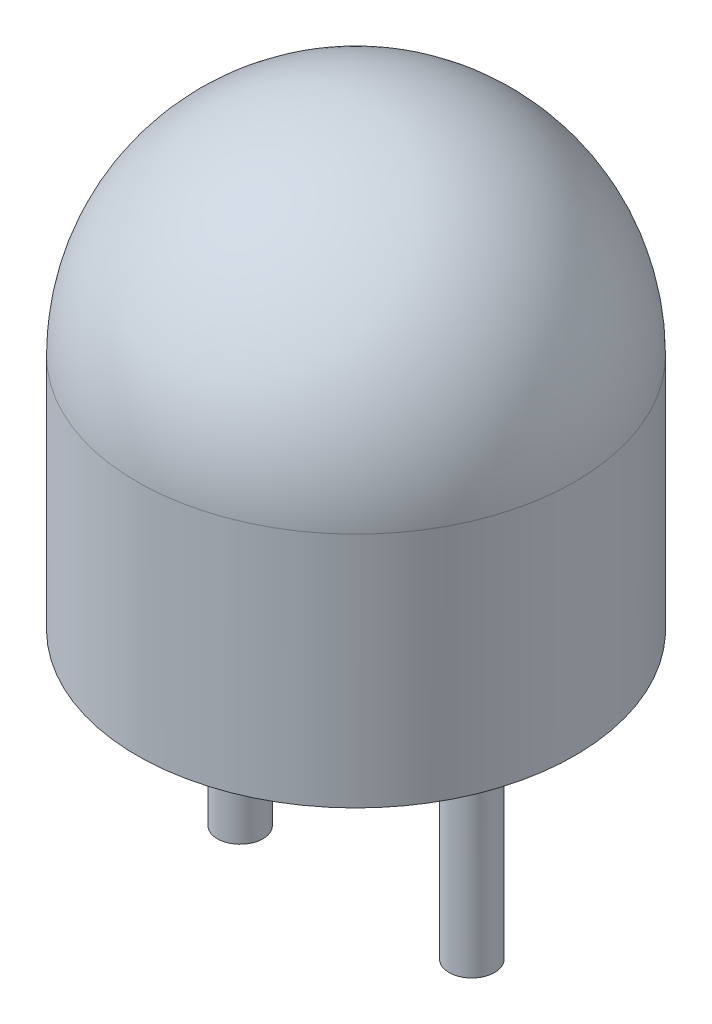
ISO-10303-21;
HEADER;
FILE_DESCRIPTION(('STEP AP214'),'2;1');
FILE_NAME('part.step','',(''),(''),'','','');
FILE_SCHEMA(('AUTOMOTIVE_DESIGN { 1 0 10303 214 1 1 1 1 }'));
ENDSEC;
DATA;
#1=APPLICATION_CONTEXT('core data for automotive mechanical design processes');
#2=APPLICATION_PROTOCOL_DEFINITION('international standard','automotive_design',2000,#1);
#3=PRODUCT_CONTEXT('',#1,'mechanical');
#4=PRODUCT('Part','Part','',(#3));
#5=PRODUCT_RELATED_PRODUCT_CATEGORY('part','',(#4));
#6=PRODUCT_DEFINITION_FORMATION('','',#4);
#7=PRODUCT_DEFINITION_CONTEXT('part definition',#1,'design');
#8=PRODUCT_DEFINITION('design','',#6,#7);
#9=PRODUCT_DEFINITION_SHAPE('','',#8);
#10=(LENGTH_UNIT() NAMED_UNIT(*) SI_UNIT(.MILLI.,.METRE.));
#11=(NAMED_UNIT(*) PLANE_ANGLE_UNIT() SI_UNIT($,.RADIAN.));
#12=(NAMED_UNIT(*) SI_UNIT($,.STERADIAN.) SOLID_ANGLE_UNIT());
#13=UNCERTAINTY_MEASURE_WITH_UNIT(LENGTH_MEASURE(1.E-05),#10,'distance_accuracy_value','');
#14=(GEOMETRIC_REPRESENTATION_CONTEXT(3) GLOBAL_UNCERTAINTY_ASSIGNED_CONTEXT((#13)) GLOBAL_UNIT_ASSIGNED_CONTEXT((#10,
#11,#12)) REPRESENTATION_CONTEXT('',''));
#15=CARTESIAN_POINT('',(0.,0.,0.));
#16=DIRECTION('',(0.,0.,1.));
#17=DIRECTION('',(1.,0.,0.));
#18=AXIS2_PLACEMENT_3D('',#15,#16,#17);
#19=CARTESIAN_POINT('',(0.,0.,0.));
#20=DIRECTION('',(0.,-1.,0.));
#21=DIRECTION('',(0.,0.,-1.));
#22=AXIS2_PLACEMENT_3D('',#19,#20,#21);
#23=PLANE('',#22);
#24=CARTESIAN_POINT('',(0.,0.,0.));
#25=DIRECTION('',(0.,-1.,0.));
#26=DIRECTION('',(0.,0.,-1.));
#27=AXIS2_PLACEMENT_3D('',#24,#25,#26);
#28=CIRCLE('',#27,2.4);
#29=CARTESIAN_POINT('',(0.,0.,-2.4));
#30=VERTEX_POINT('',#29);
#31=EDGE_CURVE('E11',#30,#30,#28,.T.);
#32=ORIENTED_EDGE('',*,*,#31,.T.);
#33=EDGE_LOOP('',(#32));
#34=FACE_BOUND('',#33,.T.);
#35=ADVANCED_FACE('F43',(#34),#23,.T.);
#36=CARTESIAN_POINT('',(0.,0.,0.));
#37=DIRECTION('',(0.,-1.,0.));
#38=DIRECTION('',(0.,0.,-1.));
#39=AXIS2_PLACEMENT_3D('',#36,#37,#38);
#40=CYLINDRICAL_SURFACE('',#39,2.4);
#41=CARTESIAN_POINT('',(0.,2.6,0.));
#42=DIRECTION('',(0.,-1.,0.));
#43=DIRECTION('',(0.,0.,-1.));
#44=AXIS2_PLACEMENT_3D('',#41,#42,#43);
#45=CIRCLE('',#44,2.4);
#46=CARTESIAN_POINT('',(0.,2.6,-2.4));
#47=VERTEX_POINT('',#46);
#48=EDGE_CURVE('E49',#47,#47,#45,.T.);
#49=ORIENTED_EDGE('',*,*,#48,.T.);
#50=EDGE_LOOP('',(#49));
#51=FACE_BOUND('',#50,.T.);
#52=ORIENTED_EDGE('',*,*,#31,.F.);
#53=EDGE_LOOP('',(#52));
#54=FACE_BOUND('',#53,.T.);
#55=ADVANCED_FACE('F55',(#51,#54),#40,.T.);
#56=CARTESIAN_POINT('',(0.,2.6,0.));
#57=DIRECTION('',(0.,-1.,0.));
#58=DIRECTION('',(1.,0.,0.));
#59=AXIS2_PLACEMENT_3D('',#56,#57,#58);
#60=SPHERICAL_SURFACE('',#59,2.4);
#61=ORIENTED_EDGE('',*,*,#48,.F.);
#62=EDGE_LOOP('',(#61));
#63=FACE_BOUND('',#62,.T.);
#64=ADVANCED_FACE('F58',(#63),#60,.T.);
#65=CLOSED_SHELL('',(#35,#55,#64));
#66=MANIFOLD_SOLID_BREP('B2',#65);
#67=CARTESIAN_POINT('',(-1.27,0.,0.));
#68=DIRECTION('',(0.,1.,0.));
#69=DIRECTION('',(0.,0.,1.));
#70=AXIS2_PLACEMENT_3D('',#67,#68,#69);
#71=PLANE('',#70);
#72=CARTESIAN_POINT('',(-1.27,0.,0.));
#73=DIRECTION('',(0.,1.,0.));
#74=DIRECTION('',(0.,0.,1.));
#75=AXIS2_PLACEMENT_3D('',#72,#73,#74);
#76=CIRCLE('',#75,0.25);
#77=CARTESIAN_POINT('',(-1.04087121525221,0.,-0.1));
#78=VERTEX_POINT('',#77);
#79=CARTESIAN_POINT('',(-1.49912878474779,0.,-0.1));
#80=VERTEX_POINT('',#79);
#81=EDGE_CURVE('E193',#78,#80,#76,.T.);
#82=ORIENTED_EDGE('',*,*,#81,.T.);
#83=DIRECTION('',(1.,0.,0.));
#84=VECTOR('',#83,1.);
#85=CARTESIAN_POINT('',(-1.02,0.,-0.1));
#86=LINE('',#85,#84);
#87=EDGE_CURVE('E41',#80,#78,#86,.T.);
#88=ORIENTED_EDGE('',*,*,#87,.T.);
#89=EDGE_LOOP('',(#82,#88));
#90=FACE_BOUND('',#89,.T.);
#91=ADVANCED_FACE('F92',(#90),#71,.T.);
#92=CARTESIAN_POINT('',(-1.27,-2.5,0.));
#93=DIRECTION('',(0.,1.,0.));
#94=DIRECTION('',(0.,0.,1.));
#95=AXIS2_PLACEMENT_3D('',#92,#93,#94);
#96=CYLINDRICAL_SURFACE('',#95,0.25);
#97=CARTESIAN_POINT('',(-1.27,-2.5,0.));
#98=DIRECTION('',(0.,1.,0.));
#99=DIRECTION('',(0.,0.,1.));
#100=AXIS2_PLACEMENT_3D('',#97,#98,#99);
#101=CIRCLE('',#100,0.25);
#102=CARTESIAN_POINT('',(-1.27,-2.5,0.25));
#103=VERTEX_POINT('',#102);
#104=EDGE_CURVE('E187',#103,#103,#101,.T.);
#105=ORIENTED_EDGE('',*,*,#104,.T.);
#106=EDGE_LOOP('',(#105));
#107=FACE_BOUND('',#106,.T.);
#108=CARTESIAN_POINT('',(-1.04087121525221,0.,0.1));
#109=VERTEX_POINT('',#108);
#110=CARTESIAN_POINT('',(-1.02,0.,0.));
#111=VERTEX_POINT('',#110);
#112=EDGE_CURVE('E96',#109,#111,#76,.T.);
#113=ORIENTED_EDGE('',*,*,#112,.F.);
#114=CARTESIAN_POINT('',(-1.49912878474779,0.,0.1));
#115=VERTEX_POINT('',#114);
#116=EDGE_CURVE('E182',#115,#109,#76,.T.);
#117=ORIENTED_EDGE('',*,*,#116,.F.);
#118=CARTESIAN_POINT('',(-1.52,0.,0.));
#119=VERTEX_POINT('',#118);
#120=EDGE_CURVE('E116',#119,#115,#76,.T.);
#121=ORIENTED_EDGE('',*,*,#120,.F.);
#122=EDGE_CURVE('E198',#80,#119,#76,.T.);
#123=ORIENTED_EDGE('',*,*,#122,.F.);
#124=ORIENTED_EDGE('',*,*,#81,.F.);
#125=EDGE_CURVE('E191',#111,#78,#76,.T.);
#126=ORIENTED_EDGE('',*,*,#125,.F.);
#127=EDGE_LOOP('',(#113,#117,#121,#123,#124,#126));
#128=FACE_BOUND('',#127,.T.);
#129=ADVANCED_FACE('F94',(#107,#128),#96,.T.);
#130=CARTESIAN_POINT('',(-1.27,-2.5,0.));
#131=DIRECTION('',(0.,1.,0.));
#132=DIRECTION('',(0.,0.,1.));
#133=AXIS2_PLACEMENT_3D('',#130,#131,#132);
#134=PLANE('',#133);
#135=ORIENTED_EDGE('',*,*,#104,.F.);
#136=EDGE_LOOP('',(#135));
#137=FACE_BOUND('',#136,.T.);
#138=ADVANCED_FACE('F251',(#137),#134,.F.);
#139=DIRECTION('',(1.,0.,0.));
#140=VECTOR('',#139,1.);
#141=CARTESIAN_POINT('',(-1.02,0.,0.1));
#142=LINE('',#141,#140);
#143=EDGE_CURVE('E101',#115,#109,#142,.T.);
#144=ORIENTED_EDGE('',*,*,#143,.F.);
#145=ORIENTED_EDGE('',*,*,#116,.T.);
#146=EDGE_LOOP('',(#144,#145));
#147=FACE_BOUND('',#146,.T.);
#148=ADVANCED_FACE('F249',(#147),#71,.T.);
#149=CARTESIAN_POINT('',(-1.02,0.,0.1));
#150=DIRECTION('',(0.,1.,0.));
#151=DIRECTION('',(0.,0.,1.));
#152=AXIS2_PLACEMENT_3D('',#149,#150,#151);
#153=PLANE('',#152);
#154=CARTESIAN_POINT('',(-1.02,0.,0.1));
#155=VERTEX_POINT('',#154);
#156=EDGE_CURVE('E159',#109,#155,#142,.T.);
#157=ORIENTED_EDGE('',*,*,#156,.F.);
#158=ORIENTED_EDGE('',*,*,#112,.T.);
#159=DIRECTION('',(0.,0.,-1.));
#160=VECTOR('',#159,1.);
#161=CARTESIAN_POINT('',(-1.02,0.,0.1));
#162=LINE('',#161,#160);
#163=EDGE_CURVE('E174',#155,#111,#162,.T.);
#164=ORIENTED_EDGE('',*,*,#163,.F.);
#165=EDGE_LOOP('',(#157,#158,#164));
#166=FACE_BOUND('',#165,.T.);
#167=ADVANCED_FACE('F180',(#166),#153,.F.);
#168=CARTESIAN_POINT('',(-1.02,0.,-0.1));
#169=VERTEX_POINT('',#168);
#170=EDGE_CURVE('E183',#111,#169,#162,.T.);
#171=ORIENTED_EDGE('',*,*,#170,.F.);
#172=ORIENTED_EDGE('',*,*,#125,.T.);
#173=EDGE_CURVE('E104',#78,#169,#86,.T.);
#174=ORIENTED_EDGE('',*,*,#173,.T.);
#175=EDGE_LOOP('',(#171,#172,#174));
#176=FACE_BOUND('',#175,.T.);
#177=ADVANCED_FACE('F256',(#176),#153,.F.);
#178=CARTESIAN_POINT('',(-1.52,0.,-0.1));
#179=VERTEX_POINT('',#178);
#180=EDGE_CURVE('E103',#179,#80,#86,.T.);
#181=ORIENTED_EDGE('',*,*,#180,.T.);
#182=ORIENTED_EDGE('',*,*,#122,.T.);
#183=DIRECTION('',(0.,0.,-1.));
#184=VECTOR('',#183,1.);
#185=CARTESIAN_POINT('',(-1.52,0.,0.1));
#186=LINE('',#185,#184);
#187=EDGE_CURVE('E217',#119,#179,#186,.T.);
#188=ORIENTED_EDGE('',*,*,#187,.T.);
#189=EDGE_LOOP('',(#181,#182,#188));
#190=FACE_BOUND('',#189,.T.);
#191=ADVANCED_FACE('F248',(#190),#153,.F.);
#192=CARTESIAN_POINT('',(-1.52,0.,0.1));
#193=VERTEX_POINT('',#192);
#194=EDGE_CURVE('E210',#193,#119,#186,.T.);
#195=ORIENTED_EDGE('',*,*,#194,.T.);
#196=ORIENTED_EDGE('',*,*,#120,.T.);
#197=EDGE_CURVE('E168',#193,#115,#142,.T.);
#198=ORIENTED_EDGE('',*,*,#197,.F.);
#199=EDGE_LOOP('',(#195,#196,#198));
#200=FACE_BOUND('',#199,.T.);
#201=ADVANCED_FACE('F208',(#200),#153,.F.);
#202=CARTESIAN_POINT('',(-1.02,1.3,0.1));
#203=DIRECTION('',(-1.,0.,0.));
#204=DIRECTION('',(0.,0.,1.));
#205=AXIS2_PLACEMENT_3D('',#202,#203,#204);
#206=PLANE('',#205);
#207=DIRECTION('',(0.,1.,0.));
#208=VECTOR('',#207,1.);
#209=CARTESIAN_POINT('',(-1.02,1.3,-0.1));
#210=LINE('',#209,#208);
#211=CARTESIAN_POINT('',(-1.02,1.3,-0.1));
#212=VERTEX_POINT('',#211);
#213=EDGE_CURVE('E219',#169,#212,#210,.T.);
#214=ORIENTED_EDGE('',*,*,#213,.T.);
#215=DIRECTION('',(0.,0.,-1.));
#216=VECTOR('',#215,1.);
#217=CARTESIAN_POINT('',(-1.02,1.3,0.1));
#218=LINE('',#217,#216);
#219=CARTESIAN_POINT('',(-1.02,1.3,0.1));
#220=VERTEX_POINT('',#219);
#221=EDGE_CURVE('E176',#220,#212,#218,.T.);
#222=ORIENTED_EDGE('',*,*,#221,.F.);
#223=DIRECTION('',(0.,1.,0.));
#224=VECTOR('',#223,1.);
#225=CARTESIAN_POINT('',(-1.02,1.3,0.1));
#226=LINE('',#225,#224);
#227=EDGE_CURVE('E163',#155,#220,#226,.T.);
#228=ORIENTED_EDGE('',*,*,#227,.F.);
#229=ORIENTED_EDGE('',*,*,#163,.T.);
#230=ORIENTED_EDGE('',*,*,#170,.T.);
#231=EDGE_LOOP('',(#214,#222,#228,#229,#230));
#232=FACE_BOUND('',#231,.T.);
#233=ADVANCED_FACE('F173',(#232),#206,.F.);
#234=CARTESIAN_POINT('',(-0.5,1.3,0.1));
#235=DIRECTION('',(0.,1.,0.));
#236=DIRECTION('',(-1.,0.,0.));
#237=AXIS2_PLACEMENT_3D('',#234,#235,#236);
#238=PLANE('',#237);
#239=DIRECTION('',(1.,0.,0.));
#240=VECTOR('',#239,1.);
#241=CARTESIAN_POINT('',(-0.5,1.3,-0.1));
#242=LINE('',#241,#240);
#243=CARTESIAN_POINT('',(-0.5,1.3,-0.1));
#244=VERTEX_POINT('',#243);
#245=EDGE_CURVE('E221',#212,#244,#242,.T.);
#246=ORIENTED_EDGE('',*,*,#245,.T.);
#247=DIRECTION('',(0.,0.,-1.));
#248=VECTOR('',#247,1.);
#249=CARTESIAN_POINT('',(-0.5,1.3,0.1));
#250=LINE('',#249,#248);
#251=CARTESIAN_POINT('',(-0.5,1.3,0.1));
#252=VERTEX_POINT('',#251);
#253=EDGE_CURVE('E230',#252,#244,#250,.T.);
#254=ORIENTED_EDGE('',*,*,#253,.F.);
#255=DIRECTION('',(1.,0.,0.));
#256=VECTOR('',#255,1.);
#257=CARTESIAN_POINT('',(-0.5,1.3,0.1));
#258=LINE('',#257,#256);
#259=EDGE_CURVE('E178',#220,#252,#258,.T.);
#260=ORIENTED_EDGE('',*,*,#259,.F.);
#261=ORIENTED_EDGE('',*,*,#221,.T.);
#262=EDGE_LOOP('',(#246,#254,#260,#261));
#263=FACE_BOUND('',#262,.T.);
#264=ADVANCED_FACE('F238',(#263),#238,.F.);
#265=CARTESIAN_POINT('',(-1.52,3.,0.1));
#266=DIRECTION('',(-0.857492925712544,-0.514495755427527,0.));
#267=DIRECTION('',(0.514495755427527,-0.857492925712544,0.));
#268=AXIS2_PLACEMENT_3D('',#265,#266,#267);
#269=PLANE('',#268);
#270=DIRECTION('',(-0.514495755427527,0.857492925712544,0.));
#271=VECTOR('',#270,1.);
#272=CARTESIAN_POINT('',(-1.52,3.,-0.1));
#273=LINE('',#272,#271);
#274=CARTESIAN_POINT('',(-1.52,3.,-0.1));
#275=VERTEX_POINT('',#274);
#276=EDGE_CURVE('E223',#244,#275,#273,.T.);
#277=ORIENTED_EDGE('',*,*,#276,.T.);
#278=DIRECTION('',(0.,0.,-1.));
#279=VECTOR('',#278,1.);
#280=CARTESIAN_POINT('',(-1.52,3.,0.1));
#281=LINE('',#280,#279);
#282=CARTESIAN_POINT('',(-1.52,3.,0.1));
#283=VERTEX_POINT('',#282);
#284=EDGE_CURVE('E228',#283,#275,#281,.T.);
#285=ORIENTED_EDGE('',*,*,#284,.F.);
#286=DIRECTION('',(-0.514495755427527,0.857492925712544,0.));
#287=VECTOR('',#286,1.);
#288=CARTESIAN_POINT('',(-1.52,3.,0.1));
#289=LINE('',#288,#287);
#290=EDGE_CURVE('E215',#252,#283,#289,.T.);
#291=ORIENTED_EDGE('',*,*,#290,.F.);
#292=ORIENTED_EDGE('',*,*,#253,.T.);
#293=EDGE_LOOP('',(#277,#285,#291,#292));
#294=FACE_BOUND('',#293,.T.);
#295=ADVANCED_FACE('F245',(#294),#269,.F.);
#296=CARTESIAN_POINT('',(-1.52,0.,0.1));
#297=DIRECTION('',(1.,0.,0.));
#298=DIRECTION('',(0.,0.,-1.));
#299=AXIS2_PLACEMENT_3D('',#296,#297,#298);
#300=PLANE('',#299);
#301=DIRECTION('',(0.,-1.,0.));
#302=VECTOR('',#301,1.);
#303=CARTESIAN_POINT('',(-1.52,0.,-0.1));
#304=LINE('',#303,#302);
#305=EDGE_CURVE('E169',#275,#179,#304,.T.);
#306=ORIENTED_EDGE('',*,*,#305,.T.);
#307=ORIENTED_EDGE('',*,*,#187,.F.);
#308=ORIENTED_EDGE('',*,*,#194,.F.);
#309=DIRECTION('',(0.,-1.,0.));
#310=VECTOR('',#309,1.);
#311=CARTESIAN_POINT('',(-1.52,0.,0.1));
#312=LINE('',#311,#310);
#313=EDGE_CURVE('E212',#283,#193,#312,.T.);
#314=ORIENTED_EDGE('',*,*,#313,.F.);
#315=ORIENTED_EDGE('',*,*,#284,.T.);
#316=EDGE_LOOP('',(#306,#307,#308,#314,#315));
#317=FACE_BOUND('',#316,.T.);
#318=ADVANCED_FACE('F247',(#317),#300,.F.);
#319=CARTESIAN_POINT('',(0.,0.,0.1));
#320=DIRECTION('',(0.,0.,-1.));
#321=DIRECTION('',(-1.,0.,0.));
#322=AXIS2_PLACEMENT_3D('',#319,#320,#321);
#323=PLANE('',#322);
#324=ORIENTED_EDGE('',*,*,#197,.T.);
#325=ORIENTED_EDGE('',*,*,#143,.T.);
#326=ORIENTED_EDGE('',*,*,#156,.T.);
#327=ORIENTED_EDGE('',*,*,#227,.T.);
#328=ORIENTED_EDGE('',*,*,#259,.T.);
#329=ORIENTED_EDGE('',*,*,#290,.T.);
#330=ORIENTED_EDGE('',*,*,#313,.T.);
#331=EDGE_LOOP('',(#324,#325,#326,#327,#328,#329,#330));
#332=FACE_BOUND('',#331,.T.);
#333=ADVANCED_FACE('F162',(#332),#323,.F.);
#334=CARTESIAN_POINT('',(0.,0.,-0.1));
#335=DIRECTION('',(0.,0.,-1.));
#336=DIRECTION('',(-1.,0.,0.));
#337=AXIS2_PLACEMENT_3D('',#334,#335,#336);
#338=PLANE('',#337);
#339=ORIENTED_EDGE('',*,*,#180,.F.);
#340=ORIENTED_EDGE('',*,*,#305,.F.);
#341=ORIENTED_EDGE('',*,*,#276,.F.);
#342=ORIENTED_EDGE('',*,*,#245,.F.);
#343=ORIENTED_EDGE('',*,*,#213,.F.);
#344=ORIENTED_EDGE('',*,*,#173,.F.);
#345=ORIENTED_EDGE('',*,*,#87,.F.);
#346=EDGE_LOOP('',(#339,#340,#341,#342,#343,#344,#345));
#347=FACE_BOUND('',#346,.T.);
#348=ADVANCED_FACE('F242',(#347),#338,.T.);
#349=CLOSED_SHELL('',(#91,#129,#138,#148,#167,#177,#191,#201,#233,#264,#295,#318,#333,#348));
#350=MANIFOLD_SOLID_BREP('B6',#349);
#351=CARTESIAN_POINT('',(1.27,0.,0.));
#352=DIRECTION('',(0.,1.,0.));
#353=DIRECTION('',(0.,0.,1.));
#354=AXIS2_PLACEMENT_3D('',#351,#352,#353);
#355=PLANE('',#354);
#356=CARTESIAN_POINT('',(1.27,0.,0.));
#357=DIRECTION('',(0.,1.,0.));
#358=DIRECTION('',(0.,0.,1.));
#359=AXIS2_PLACEMENT_3D('',#356,#357,#358);
#360=CIRCLE('',#359,0.25);
#361=CARTESIAN_POINT('',(1.49912878474779,0.,-0.1));
#362=VERTEX_POINT('',#361);
#363=CARTESIAN_POINT('',(1.04087121525221,0.,-0.1));
#364=VERTEX_POINT('',#363);
#365=EDGE_CURVE('E561',#362,#364,#360,.T.);
#366=ORIENTED_EDGE('',*,*,#365,.T.);
#367=DIRECTION('',(1.,0.,0.));
#368=VECTOR('',#367,1.);
#369=CARTESIAN_POINT('',(1.02,0.,-0.1));
#370=LINE('',#369,#368);
#371=EDGE_CURVE('E374',#364,#362,#370,.T.);
#372=ORIENTED_EDGE('',*,*,#371,.T.);
#373=EDGE_LOOP('',(#366,#372));
#374=FACE_BOUND('',#373,.T.);
#375=ADVANCED_FACE('F361',(#374),#355,.T.);
#376=CARTESIAN_POINT('',(1.27,-2.5,0.));
#377=DIRECTION('',(0.,1.,0.));
#378=DIRECTION('',(0.,0.,1.));
#379=AXIS2_PLACEMENT_3D('',#376,#377,#378);
#380=CYLINDRICAL_SURFACE('',#379,0.25);
#381=CARTESIAN_POINT('',(1.27,-2.5,0.));
#382=DIRECTION('',(0.,1.,0.));
#383=DIRECTION('',(0.,0.,1.));
#384=AXIS2_PLACEMENT_3D('',#381,#382,#383);
#385=CIRCLE('',#384,0.25);
#386=CARTESIAN_POINT('',(1.27,-2.5,0.25));
#387=VERTEX_POINT('',#386);
#388=EDGE_CURVE('E511',#387,#387,#385,.T.);
#389=ORIENTED_EDGE('',*,*,#388,.T.);
#390=EDGE_LOOP('',(#389));
#391=FACE_BOUND('',#390,.T.);
#392=CARTESIAN_POINT('',(1.49912878474779,0.,0.1));
#393=VERTEX_POINT('',#392);
#394=CARTESIAN_POINT('',(1.52,0.,0.));
#395=VERTEX_POINT('',#394);
#396=EDGE_CURVE('E518',#393,#395,#360,.T.);
#397=ORIENTED_EDGE('',*,*,#396,.F.);
#398=CARTESIAN_POINT('',(1.04087121525221,0.,0.1));
#399=VERTEX_POINT('',#398);
#400=EDGE_CURVE('E508',#399,#393,#360,.T.);
#401=ORIENTED_EDGE('',*,*,#400,.F.);
#402=CARTESIAN_POINT('',(1.02,0.,0.));
#403=VERTEX_POINT('',#402);
#404=EDGE_CURVE('E515',#403,#399,#360,.T.);
#405=ORIENTED_EDGE('',*,*,#404,.F.);
#406=EDGE_CURVE('E525',#364,#403,#360,.T.);
#407=ORIENTED_EDGE('',*,*,#406,.F.);
#408=ORIENTED_EDGE('',*,*,#365,.F.);
#409=EDGE_CURVE('E557',#395,#362,#360,.T.);
#410=ORIENTED_EDGE('',*,*,#409,.F.);
#411=EDGE_LOOP('',(#397,#401,#405,#407,#408,#410));
#412=FACE_BOUND('',#411,.T.);
#413=ADVANCED_FACE('F363',(#391,#412),#380,.T.);
#414=CARTESIAN_POINT('',(1.27,-2.5,0.));
#415=DIRECTION('',(0.,1.,0.));
#416=DIRECTION('',(0.,0.,1.));
#417=AXIS2_PLACEMENT_3D('',#414,#415,#416);
#418=PLANE('',#417);
#419=ORIENTED_EDGE('',*,*,#388,.F.);
#420=EDGE_LOOP('',(#419));
#421=FACE_BOUND('',#420,.T.);
#422=ADVANCED_FACE('F488',(#421),#418,.F.);
#423=DIRECTION('',(1.,0.,0.));
#424=VECTOR('',#423,1.);
#425=CARTESIAN_POINT('',(1.02,0.,0.1));
#426=LINE('',#425,#424);
#427=EDGE_CURVE('E506',#399,#393,#426,.T.);
#428=ORIENTED_EDGE('',*,*,#427,.F.);
#429=ORIENTED_EDGE('',*,*,#400,.T.);
#430=EDGE_LOOP('',(#428,#429));
#431=FACE_BOUND('',#430,.T.);
#432=ADVANCED_FACE('F484',(#431),#355,.T.);
#433=CARTESIAN_POINT('',(1.02,0.,0.1));
#434=DIRECTION('',(0.,1.,0.));
#435=DIRECTION('',(0.,0.,1.));
#436=AXIS2_PLACEMENT_3D('',#433,#434,#435);
#437=PLANE('',#436);
#438=CARTESIAN_POINT('',(1.52,0.,0.1));
#439=VERTEX_POINT('',#438);
#440=EDGE_CURVE('E512',#393,#439,#426,.T.);
#441=ORIENTED_EDGE('',*,*,#440,.F.);
#442=ORIENTED_EDGE('',*,*,#396,.T.);
#443=DIRECTION('',(0.,0.,-1.));
#444=VECTOR('',#443,1.);
#445=CARTESIAN_POINT('',(1.52,0.,0.1));
#446=LINE('',#445,#444);
#447=EDGE_CURVE('E519',#439,#395,#446,.T.);
#448=ORIENTED_EDGE('',*,*,#447,.F.);
#449=EDGE_LOOP('',(#441,#442,#448));
#450=FACE_BOUND('',#449,.T.);
#451=ADVANCED_FACE('F493',(#450),#437,.F.);
#452=CARTESIAN_POINT('',(1.52,0.,-0.1));
#453=VERTEX_POINT('',#452);
#454=EDGE_CURVE('E553',#395,#453,#446,.T.);
#455=ORIENTED_EDGE('',*,*,#454,.F.);
#456=ORIENTED_EDGE('',*,*,#409,.T.);
#457=EDGE_CURVE('E461',#362,#453,#370,.T.);
#458=ORIENTED_EDGE('',*,*,#457,.T.);
#459=EDGE_LOOP('',(#455,#456,#458));
#460=FACE_BOUND('',#459,.T.);
#461=ADVANCED_FACE('F499',(#460),#437,.F.);
#462=CARTESIAN_POINT('',(1.02,0.,-0.1));
#463=VERTEX_POINT('',#462);
#464=EDGE_CURVE('E570',#463,#364,#370,.T.);
#465=ORIENTED_EDGE('',*,*,#464,.T.);
#466=ORIENTED_EDGE('',*,*,#406,.T.);
#467=DIRECTION('',(0.,0.,-1.));
#468=VECTOR('',#467,1.);
#469=CARTESIAN_POINT('',(1.02,0.,0.1));
#470=LINE('',#469,#468);
#471=EDGE_CURVE('E543',#403,#463,#470,.T.);
#472=ORIENTED_EDGE('',*,*,#471,.T.);
#473=EDGE_LOOP('',(#465,#466,#472));
#474=FACE_BOUND('',#473,.T.);
#475=ADVANCED_FACE('F569',(#474),#437,.F.);
#476=CARTESIAN_POINT('',(1.02,0.,0.1));
#477=VERTEX_POINT('',#476);
#478=EDGE_CURVE('E524',#477,#403,#470,.T.);
#479=ORIENTED_EDGE('',*,*,#478,.T.);
#480=ORIENTED_EDGE('',*,*,#404,.T.);
#481=EDGE_CURVE('E471',#477,#399,#426,.T.);
#482=ORIENTED_EDGE('',*,*,#481,.F.);
#483=EDGE_LOOP('',(#479,#480,#482));
#484=FACE_BOUND('',#483,.T.);
#485=ADVANCED_FACE('F502',(#484),#437,.F.);
#486=CARTESIAN_POINT('',(1.52,0.,0.1));
#487=DIRECTION('',(-1.,0.,0.));
#488=DIRECTION('',(0.,0.,1.));
#489=AXIS2_PLACEMENT_3D('',#486,#487,#488);
#490=PLANE('',#489);
#491=DIRECTION('',(0.,1.,0.));
#492=VECTOR('',#491,1.);
#493=CARTESIAN_POINT('',(1.52,0.,-0.1));
#494=LINE('',#493,#492);
#495=CARTESIAN_POINT('',(1.52,3.,-0.1));
#496=VERTEX_POINT('',#495);
#497=EDGE_CURVE('E578',#453,#496,#494,.T.);
#498=ORIENTED_EDGE('',*,*,#497,.T.);
#499=DIRECTION('',(0.,0.,-1.));
#500=VECTOR('',#499,1.);
#501=CARTESIAN_POINT('',(1.52,3.,0.1));
#502=LINE('',#501,#500);
#503=CARTESIAN_POINT('',(1.52,3.,0.1));
#504=VERTEX_POINT('',#503);
#505=EDGE_CURVE('E551',#504,#496,#502,.T.);
#506=ORIENTED_EDGE('',*,*,#505,.F.);
#507=DIRECTION('',(0.,1.,0.));
#508=VECTOR('',#507,1.);
#509=CARTESIAN_POINT('',(1.52,0.,0.1));
#510=LINE('',#509,#508);
#511=EDGE_CURVE('E449',#439,#504,#510,.T.);
#512=ORIENTED_EDGE('',*,*,#511,.F.);
#513=ORIENTED_EDGE('',*,*,#447,.T.);
#514=ORIENTED_EDGE('',*,*,#454,.T.);
#515=EDGE_LOOP('',(#498,#506,#512,#513,#514));
#516=FACE_BOUND('',#515,.T.);
#517=ADVANCED_FACE('F598',(#516),#490,.F.);
#518=CARTESIAN_POINT('',(1.52,3.,0.1));
#519=DIRECTION('',(0.,-1.,0.));
#520=DIRECTION('',(0.,0.,-1.));
#521=AXIS2_PLACEMENT_3D('',#518,#519,#520);
#522=PLANE('',#521);
#523=DIRECTION('',(-1.,0.,0.));
#524=VECTOR('',#523,1.);
#525=CARTESIAN_POINT('',(1.52,3.,0.1));
#526=LINE('',#525,#524);
#527=CARTESIAN_POINT('',(-0.489897948556635,3.,0.1));
#528=VERTEX_POINT('',#527);
#529=CARTESIAN_POINT('',(-1.02,3.,0.1));
#530=VERTEX_POINT('',#529);
#531=EDGE_CURVE('E455',#528,#530,#526,.T.);
#532=ORIENTED_EDGE('',*,*,#531,.F.);
#533=CARTESIAN_POINT('',(0.,3.,0.));
#534=DIRECTION('',(0.,-1.,0.));
#535=DIRECTION('',(0.,0.,-1.));
#536=AXIS2_PLACEMENT_3D('',#533,#534,#535);
#537=CIRCLE('',#536,0.5);
#538=CARTESIAN_POINT('',(0.489897948556636,3.,0.1));
#539=VERTEX_POINT('',#538);
#540=EDGE_CURVE('E460',#539,#528,#537,.T.);
#541=ORIENTED_EDGE('',*,*,#540,.F.);
#542=EDGE_CURVE('E446',#504,#539,#526,.T.);
#543=ORIENTED_EDGE('',*,*,#542,.F.);
#544=ORIENTED_EDGE('',*,*,#505,.T.);
#545=DIRECTION('',(-1.,0.,0.));
#546=VECTOR('',#545,1.);
#547=CARTESIAN_POINT('',(1.52,3.,-0.1));
#548=LINE('',#547,#546);
#549=CARTESIAN_POINT('',(0.489897948556636,3.,-0.1));
#550=VERTEX_POINT('',#549);
#551=EDGE_CURVE('E581',#496,#550,#548,.T.);
#552=ORIENTED_EDGE('',*,*,#551,.T.);
#553=CARTESIAN_POINT('',(-0.489897948556635,3.,-0.1));
#554=VERTEX_POINT('',#553);
#555=EDGE_CURVE('E388',#554,#550,#537,.T.);
#556=ORIENTED_EDGE('',*,*,#555,.F.);
#557=CARTESIAN_POINT('',(-1.02,3.,-0.1));
#558=VERTEX_POINT('',#557);
#559=EDGE_CURVE('E580',#554,#558,#548,.T.);
#560=ORIENTED_EDGE('',*,*,#559,.T.);
#561=DIRECTION('',(0.,0.,-1.));
#562=VECTOR('',#561,1.);
#563=CARTESIAN_POINT('',(-1.02,3.,0.1));
#564=LINE('',#563,#562);
#565=EDGE_CURVE('E548',#530,#558,#564,.T.);
#566=ORIENTED_EDGE('',*,*,#565,.F.);
#567=EDGE_LOOP('',(#532,#541,#543,#544,#552,#556,#560,#566));
#568=FACE_BOUND('',#567,.T.);
#569=ADVANCED_FACE('F463',(#568),#522,.F.);
#570=CARTESIAN_POINT('',(-1.02,3.,0.1));
#571=DIRECTION('',(0.857492925712544,0.514495755427527,0.));
#572=DIRECTION('',(-0.514495755427527,0.857492925712544,0.));
#573=AXIS2_PLACEMENT_3D('',#570,#571,#572);
#574=PLANE('',#573);
#575=DIRECTION('',(0.514495755427527,-0.857492925712544,0.));
#576=VECTOR('',#575,1.);
#577=CARTESIAN_POINT('',(-1.02,3.,-0.1));
#578=LINE('',#577,#576);
#579=CARTESIAN_POINT('',(0.,1.3,-0.1));
#580=VERTEX_POINT('',#579);
#581=EDGE_CURVE('E537',#558,#580,#578,.T.);
#582=ORIENTED_EDGE('',*,*,#581,.T.);
#583=DIRECTION('',(0.,0.,-1.));
#584=VECTOR('',#583,1.);
#585=CARTESIAN_POINT('',(0.,1.3,0.1));
#586=LINE('',#585,#584);
#587=CARTESIAN_POINT('',(0.,1.3,0.1));
#588=VERTEX_POINT('',#587);
#589=EDGE_CURVE('E545',#588,#580,#586,.T.);
#590=ORIENTED_EDGE('',*,*,#589,.F.);
#591=DIRECTION('',(0.514495755427527,-0.857492925712544,0.));
#592=VECTOR('',#591,1.);
#593=CARTESIAN_POINT('',(-1.02,3.,0.1));
#594=LINE('',#593,#592);
#595=EDGE_CURVE('E454',#530,#588,#594,.T.);
#596=ORIENTED_EDGE('',*,*,#595,.F.);
#597=ORIENTED_EDGE('',*,*,#565,.T.);
#598=EDGE_LOOP('',(#582,#590,#596,#597));
#599=FACE_BOUND('',#598,.T.);
#600=ADVANCED_FACE('F586',(#599),#574,.F.);
#601=CARTESIAN_POINT('',(1.02,1.912,0.1));
#602=DIRECTION('',(0.,0.,-1.));
#603=DIRECTION('',(-1.,0.,0.));
#604=AXIS2_PLACEMENT_3D('',#601,#602,#603);
#605=CYLINDRICAL_SURFACE('',#604,1.18951418654844);
#606=CARTESIAN_POINT('',(1.02,1.912,-0.1));
#607=DIRECTION('',(0.,0.,1.));
#608=DIRECTION('',(1.,0.,0.));
#609=AXIS2_PLACEMENT_3D('',#606,#607,#608);
#610=CIRCLE('',#609,1.18951418654844);
#611=CARTESIAN_POINT('',(1.02,0.722485813451559,-0.1));
#612=VERTEX_POINT('',#611);
#613=EDGE_CURVE('E530',#580,#612,#610,.T.);
#614=ORIENTED_EDGE('',*,*,#613,.T.);
#615=DIRECTION('',(0.,0.,-1.));
#616=VECTOR('',#615,1.);
#617=CARTESIAN_POINT('',(1.02,0.722485813451559,0.1));
#618=LINE('',#617,#616);
#619=CARTESIAN_POINT('',(1.02,0.722485813451559,0.1));
#620=VERTEX_POINT('',#619);
#621=EDGE_CURVE('E542',#620,#612,#618,.T.);
#622=ORIENTED_EDGE('',*,*,#621,.F.);
#623=CARTESIAN_POINT('',(1.02,1.912,0.1));
#624=DIRECTION('',(0.,0.,1.));
#625=DIRECTION('',(1.,0.,0.));
#626=AXIS2_PLACEMENT_3D('',#623,#624,#625);
#627=CIRCLE('',#626,1.18951418654844);
#628=EDGE_CURVE('E572',#588,#620,#627,.T.);
#629=ORIENTED_EDGE('',*,*,#628,.F.);
#630=ORIENTED_EDGE('',*,*,#589,.T.);
#631=EDGE_LOOP('',(#614,#622,#629,#630));
#632=FACE_BOUND('',#631,.T.);
#633=ADVANCED_FACE('F593',(#632),#605,.T.);
#634=CARTESIAN_POINT('',(1.02,0.722485813451559,0.1));
#635=DIRECTION('',(1.,0.,0.));
#636=DIRECTION('',(0.,1.,0.));
#637=AXIS2_PLACEMENT_3D('',#634,#635,#636);
#638=PLANE('',#637);
#639=DIRECTION('',(0.,-1.,0.));
#640=VECTOR('',#639,1.);
#641=CARTESIAN_POINT('',(1.02,0.722485813451559,-0.1));
#642=LINE('',#641,#640);
#643=EDGE_CURVE('E528',#612,#463,#642,.T.);
#644=ORIENTED_EDGE('',*,*,#643,.T.);
#645=ORIENTED_EDGE('',*,*,#471,.F.);
#646=ORIENTED_EDGE('',*,*,#478,.F.);
#647=DIRECTION('',(0.,-1.,0.));
#648=VECTOR('',#647,1.);
#649=CARTESIAN_POINT('',(1.02,0.722485813451559,0.1));
#650=LINE('',#649,#648);
#651=EDGE_CURVE('E527',#620,#477,#650,.T.);
#652=ORIENTED_EDGE('',*,*,#651,.F.);
#653=ORIENTED_EDGE('',*,*,#621,.T.);
#654=EDGE_LOOP('',(#644,#645,#646,#652,#653));
#655=FACE_BOUND('',#654,.T.);
#656=ADVANCED_FACE('F571',(#655),#638,.F.);
#657=CARTESIAN_POINT('',(1.02,1.912,0.1));
#658=DIRECTION('',(0.,0.,1.));
#659=DIRECTION('',(1.,0.,0.));
#660=AXIS2_PLACEMENT_3D('',#657,#658,#659);
#661=PLANE('',#660);
#662=CARTESIAN_POINT('',(-1.63951368028807,4.1425605339992,0.1));
#663=CARTESIAN_POINT('',(-1.58361226953972,4.0867636088036,0.1));
#664=CARTESIAN_POINT('',(-1.52770631725868,4.0309712314366,0.1));
#665=CARTESIAN_POINT('',(-1.41587916816759,3.91940086543415,0.1));
#666=CARTESIAN_POINT('',(-1.35995797123958,3.86362287691694,0.1));
#667=CARTESIAN_POINT('',(-1.24808043836069,3.75207289017278,0.1));
#668=CARTESIAN_POINT('',(-1.1921240970452,3.69630089732524,0.1));
#669=CARTESIAN_POINT('',(-1.08018072424068,3.58478857940079,0.1));
#670=CARTESIAN_POINT('',(-1.02419369299013,3.52904825408447,0.1));
#671=CARTESIAN_POINT('',(-0.913191269006926,3.41863254734674,0.1));
#672=CARTESIAN_POINT('',(-0.858176765511359,3.36395627261151,0.1));
#673=CARTESIAN_POINT('',(-0.748062839296236,3.25468688384997,0.1));
#674=CARTESIAN_POINT('',(-0.692963414719079,3.20009377169626,0.1));
#675=CARTESIAN_POINT('',(-0.582619476068062,3.09107303131423,0.1));
#676=CARTESIAN_POINT('',(-0.527374988762195,3.03664537607465,0.1));
#677=CARTESIAN_POINT('',(-0.444218908197295,2.95530115920158,0.1));
#678=CARTESIAN_POINT('',(-0.416452486461712,2.92823644358792,0.1));
#679=CARTESIAN_POINT('',(-0.360747788608976,2.87428475082994,0.1));
#680=CARTESIAN_POINT('',(-0.332809514168564,2.84739777195677,0.1));
#681=CARTESIAN_POINT('',(-0.283769557951954,2.80080333788502,0.1));
#682=CARTESIAN_POINT('',(-0.262744282974584,2.78101612002673,0.1));
#683=CARTESIAN_POINT('',(-0.220264304348222,2.74176230959819,0.1));
#684=CARTESIAN_POINT('',(-0.198808380190392,2.72229704146921,0.1));
#685=CARTESIAN_POINT('',(-0.159065475756741,2.68766900722112,0.1));
#686=CARTESIAN_POINT('',(-0.140906866529624,2.67236461274203,0.1));
#687=CARTESIAN_POINT('',(-0.112748554294145,2.65059388948322,0.1));
#688=CARTESIAN_POINT('',(-0.103211632294596,2.64353629624455,0.1));
#689=CARTESIAN_POINT('',(-0.0836375652253247,2.63016541691967,0.1));
#690=CARTESIAN_POINT('',(-0.0736015684491158,2.62385052535387,0.1));
#691=CARTESIAN_POINT('',(-0.0554070709283646,2.61413668407083,0.1));
#692=CARTESIAN_POINT('',(-0.0474324889492777,2.61040579454317,0.1));
#693=CARTESIAN_POINT('',(-0.0309797067103954,2.6044160980115,0.1));
#694=CARTESIAN_POINT('',(-0.0225067804479481,2.60214413761967,0.1));
#695=CARTESIAN_POINT('',(-0.00770392125569491,2.60010998206723,0.1));
#696=CARTESIAN_POINT('',(-0.00145051997847641,2.59981746443807,0.1));
#697=CARTESIAN_POINT('',(0.0110049953776074,2.60041062473357,0.1));
#698=CARTESIAN_POINT('',(0.0172070246405527,2.60129796566863,0.1));
#699=CARTESIAN_POINT('',(0.0316580444485671,2.60457242408247,0.1));
#700=CARTESIAN_POINT('',(0.0398025837152463,2.60739714385742,0.1));
#701=CARTESIAN_POINT('',(0.0556147967725148,2.61419813504601,0.1));
#702=CARTESIAN_POINT('',(0.0632791988636251,2.61818144147269,0.1));
#703=CARTESIAN_POINT('',(0.0783154731689744,2.62686763728602,0.1));
#704=CARTESIAN_POINT('',(0.0856820536470038,2.63157944844501,0.1));
#705=CARTESIAN_POINT('',(0.100135096700697,2.6414187445222,0.1));
#706=CARTESIAN_POINT('',(0.107221329248884,2.64654656066735,0.1));
#707=CARTESIAN_POINT('',(0.128224329341249,2.66234145472957,0.1));
#708=CARTESIAN_POINT('',(0.141847162333762,2.67339539980956,0.1));
#709=CARTESIAN_POINT('',(0.168744645798587,2.69601939023996,0.1));
#710=CARTESIAN_POINT('',(0.182017565778501,2.70759143358688,0.1));
#711=CARTESIAN_POINT('',(0.208300760731653,2.73098398192467,0.1));
#712=CARTESIAN_POINT('',(0.221311457466243,2.74280401294639,0.1));
#713=CARTESIAN_POINT('',(0.259802246373942,2.778198989502,0.1));
#714=CARTESIAN_POINT('',(0.28507324520999,2.80199990756143,0.1));
#715=CARTESIAN_POINT('',(0.335359503260721,2.84987185532505,0.1));
#716=CARTESIAN_POINT('',(0.360374743405145,2.87394290489452,0.1));
#717=CARTESIAN_POINT('',(0.435251623648349,2.94640835592338,0.1));
#718=CARTESIAN_POINT('',(0.484904982213579,2.99501775563064,0.1));
#719=CARTESIAN_POINT('',(0.583724384738936,3.09216605170178,0.1));
#720=CARTESIAN_POINT('',(0.632891593260298,3.14070377126452,0.1));
#721=CARTESIAN_POINT('',(0.731102967435102,3.2378756282001,0.1));
#722=CARTESIAN_POINT('',(0.780147164268083,3.28650973401292,0.1));
#723=CARTESIAN_POINT('',(0.959776528483262,3.46484119391064,0.1));
#724=CARTESIAN_POINT('',(1.09019161395806,3.59470964347612,0.1));
#725=CARTESIAN_POINT('',(1.35091976789535,3.85458102563655,0.1));
#726=CARTESIAN_POINT('',(1.48123282172983,3.98458397288971,0.1));
#727=CARTESIAN_POINT('',(1.74317792598549,4.24602348863297,0.1));
#728=CARTESIAN_POINT('',(1.87480935373545,4.37746068112417,0.1));
#729=CARTESIAN_POINT('',(2.13802223138147,4.64035182415655,0.1));
#730=CARTESIAN_POINT('',(2.26960368549235,4.77180577047744,0.1));
#731=CARTESIAN_POINT('',(2.40118171481541,4.90326312075143,0.1));
#732=B_SPLINE_CURVE_WITH_KNOTS('',3,(#662,#663,#664,#665,#666,#667,#668,#669,#670,#671,#672,
#673,#674,#675,#676,#677,#678,#679,#680,#681,#682,#683,#684,#685,#686,#687,#688,#689,#690,#691,
#692,#693,#694,#695,#696,#697,#698,#699,#700,#701,#702,#703,#704,#705,#706,#707,#708,#709,#710,
#711,#712,#713,#714,#715,#716,#717,#718,#719,#720,#721,#722,#723,#724,#725,#726,#727,#728,#729,
#730,#731),.UNSPECIFIED.,.F.,.F.,(4,2,2,2,2,2,2,2,2,2,2,2,2,2,2,2,2,2,2,2,2,2,2,2,2,2,2,2,2,2,2,
2,2,2,4),(0.,0.236948057894884,0.47389800453932,0.710909904995594,0.947919989015509,
1.180610293437,1.41330576219497,1.64596094849848,1.76228440141697,1.87860672117993,
1.9652190313669,2.05212688367987,2.12332272190409,2.1589022676578,2.19440343052957,
2.22074231890565,2.24684027789756,2.26550934986079,2.28420476379118,2.30991025009302,
2.33577520192863,2.3619865163546,2.38821890923872,2.4408196342038,2.49364443974575,
2.54637612184068,2.65051490008641,2.75466138746891,2.96311721539891,3.17038512495278,
3.37759373194689,3.92973940887399,4.48195343943528,5.04000639162674,5.59798878265864),.UNSPECIFIED.);
#733=EDGE_CURVE('E381',#528,#539,#732,.T.);
#734=ORIENTED_EDGE('',*,*,#733,.F.);
#735=ORIENTED_EDGE('',*,*,#531,.T.);
#736=ORIENTED_EDGE('',*,*,#595,.T.);
#737=ORIENTED_EDGE('',*,*,#628,.T.);
#738=ORIENTED_EDGE('',*,*,#651,.T.);
#739=ORIENTED_EDGE('',*,*,#481,.T.);
#740=ORIENTED_EDGE('',*,*,#427,.T.);
#741=ORIENTED_EDGE('',*,*,#440,.T.);
#742=ORIENTED_EDGE('',*,*,#511,.T.);
#743=ORIENTED_EDGE('',*,*,#542,.T.);
#744=EDGE_LOOP('',(#734,#735,#736,#737,#738,#739,#740,#741,#742,#743));
#745=FACE_BOUND('',#744,.T.);
#746=ADVANCED_FACE('F447',(#745),#661,.T.);
#747=CARTESIAN_POINT('',(1.02,1.912,-0.1));
#748=DIRECTION('',(0.,0.,1.));
#749=DIRECTION('',(1.,0.,0.));
#750=AXIS2_PLACEMENT_3D('',#747,#748,#749);
#751=PLANE('',#750);
#752=ORIENTED_EDGE('',*,*,#559,.F.);
#753=CARTESIAN_POINT('',(-1.63951368028807,4.1425605339992,-0.1));
#754=CARTESIAN_POINT('',(-1.58361226953972,4.0867636088036,-0.1));
#755=CARTESIAN_POINT('',(-1.52770631725868,4.0309712314366,-0.1));
#756=CARTESIAN_POINT('',(-1.41587916816759,3.91940086543415,-0.1));
#757=CARTESIAN_POINT('',(-1.35995797123958,3.86362287691694,-0.1));
#758=CARTESIAN_POINT('',(-1.24808043836069,3.75207289017278,-0.1));
#759=CARTESIAN_POINT('',(-1.1921240970452,3.69630089732524,-0.1));
#760=CARTESIAN_POINT('',(-1.08018072424068,3.58478857940079,-0.1));
#761=CARTESIAN_POINT('',(-1.02419369299013,3.52904825408447,-0.1));
#762=CARTESIAN_POINT('',(-0.913191269006926,3.41863254734674,-0.1));
#763=CARTESIAN_POINT('',(-0.858176765511359,3.36395627261151,-0.1));
#764=CARTESIAN_POINT('',(-0.748062839296236,3.25468688384997,-0.1));
#765=CARTESIAN_POINT('',(-0.692963414719079,3.20009377169626,-0.1));
#766=CARTESIAN_POINT('',(-0.582619476068062,3.09107303131423,-0.1));
#767=CARTESIAN_POINT('',(-0.527374988762195,3.03664537607465,-0.1));
#768=CARTESIAN_POINT('',(-0.444218908197295,2.95530115920158,-0.1));
#769=CARTESIAN_POINT('',(-0.416452486461712,2.92823644358792,-0.1));
#770=CARTESIAN_POINT('',(-0.360747788608976,2.87428475082994,-0.1));
#771=CARTESIAN_POINT('',(-0.332809514168564,2.84739777195677,-0.1));
#772=CARTESIAN_POINT('',(-0.283769557951954,2.80080333788502,-0.1));
#773=CARTESIAN_POINT('',(-0.262744282974584,2.78101612002673,-0.1));
#774=CARTESIAN_POINT('',(-0.220264304348222,2.74176230959819,-0.1));
#775=CARTESIAN_POINT('',(-0.198808380190392,2.72229704146921,-0.1));
#776=CARTESIAN_POINT('',(-0.159065475756741,2.68766900722112,-0.1));
#777=CARTESIAN_POINT('',(-0.140906866529624,2.67236461274203,-0.1));
#778=CARTESIAN_POINT('',(-0.112748554294145,2.65059388948322,-0.1));
#779=CARTESIAN_POINT('',(-0.103211632294596,2.64353629624455,-0.1));
#780=CARTESIAN_POINT('',(-0.0836375652253247,2.63016541691967,-0.1));
#781=CARTESIAN_POINT('',(-0.0736015684491158,2.62385052535387,-0.1));
#782=CARTESIAN_POINT('',(-0.0554070709283646,2.61413668407083,-0.1));
#783=CARTESIAN_POINT('',(-0.0474324889492777,2.61040579454317,-0.1));
#784=CARTESIAN_POINT('',(-0.0309797067103954,2.6044160980115,-0.1));
#785=CARTESIAN_POINT('',(-0.0225067804479481,2.60214413761967,-0.1));
#786=CARTESIAN_POINT('',(-0.00770392125569491,2.60010998206723,-0.1));
#787=CARTESIAN_POINT('',(-0.00145051997847641,2.59981746443807,-0.1));
#788=CARTESIAN_POINT('',(0.0110049953776074,2.60041062473357,-0.1));
#789=CARTESIAN_POINT('',(0.0172070246405527,2.60129796566863,-0.1));
#790=CARTESIAN_POINT('',(0.0316580444485671,2.60457242408247,-0.1));
#791=CARTESIAN_POINT('',(0.0398025837152463,2.60739714385742,-0.1));
#792=CARTESIAN_POINT('',(0.0556147967725148,2.61419813504601,-0.1));
#793=CARTESIAN_POINT('',(0.0632791988636251,2.61818144147269,-0.1));
#794=CARTESIAN_POINT('',(0.0783154731689744,2.62686763728602,-0.1));
#795=CARTESIAN_POINT('',(0.0856820536470038,2.63157944844501,-0.1));
#796=CARTESIAN_POINT('',(0.100135096700697,2.6414187445222,-0.1));
#797=CARTESIAN_POINT('',(0.107221329248884,2.64654656066735,-0.1));
#798=CARTESIAN_POINT('',(0.128224329341249,2.66234145472957,-0.1));
#799=CARTESIAN_POINT('',(0.141847162333762,2.67339539980956,-0.1));
#800=CARTESIAN_POINT('',(0.168744645798587,2.69601939023996,-0.1));
#801=CARTESIAN_POINT('',(0.182017565778501,2.70759143358688,-0.1));
#802=CARTESIAN_POINT('',(0.208300760731653,2.73098398192467,-0.1));
#803=CARTESIAN_POINT('',(0.221311457466243,2.74280401294639,-0.1));
#804=CARTESIAN_POINT('',(0.259802246373942,2.778198989502,-0.1));
#805=CARTESIAN_POINT('',(0.28507324520999,2.80199990756143,-0.1));
#806=CARTESIAN_POINT('',(0.335359503260721,2.84987185532505,-0.1));
#807=CARTESIAN_POINT('',(0.360374743405145,2.87394290489452,-0.1));
#808=CARTESIAN_POINT('',(0.435251623648349,2.94640835592338,-0.1));
#809=CARTESIAN_POINT('',(0.484904982213579,2.99501775563064,-0.1));
#810=CARTESIAN_POINT('',(0.583724384738936,3.09216605170178,-0.1));
#811=CARTESIAN_POINT('',(0.632891593260298,3.14070377126452,-0.1));
#812=CARTESIAN_POINT('',(0.731102967435102,3.2378756282001,-0.1));
#813=CARTESIAN_POINT('',(0.780147164268083,3.28650973401292,-0.1));
#814=CARTESIAN_POINT('',(0.959776528483262,3.46484119391064,-0.1));
#815=CARTESIAN_POINT('',(1.09019161395806,3.59470964347612,-0.1));
#816=CARTESIAN_POINT('',(1.35091976789535,3.85458102563655,-0.1));
#817=CARTESIAN_POINT('',(1.48123282172983,3.98458397288971,-0.1));
#818=CARTESIAN_POINT('',(1.74317792598549,4.24602348863297,-0.1));
#819=CARTESIAN_POINT('',(1.87480935373545,4.37746068112417,-0.1));
#820=CARTESIAN_POINT('',(2.13802223138147,4.64035182415655,-0.1));
#821=CARTESIAN_POINT('',(2.26960368549235,4.77180577047744,-0.1));
#822=CARTESIAN_POINT('',(2.40118171481541,4.90326312075143,-0.1));
#823=B_SPLINE_CURVE_WITH_KNOTS('',3,(#753,#754,#755,#756,#757,#758,#759,#760,#761,#762,#763,
#764,#765,#766,#767,#768,#769,#770,#771,#772,#773,#774,#775,#776,#777,#778,#779,#780,#781,#782,
#783,#784,#785,#786,#787,#788,#789,#790,#791,#792,#793,#794,#795,#796,#797,#798,#799,#800,#801,
#802,#803,#804,#805,#806,#807,#808,#809,#810,#811,#812,#813,#814,#815,#816,#817,#818,#819,#820,
#821,#822),.UNSPECIFIED.,.F.,.F.,(4,2,2,2,2,2,2,2,2,2,2,2,2,2,2,2,2,2,2,2,2,2,2,2,2,2,2,2,2,2,2,
2,2,2,4),(0.,0.236948057894884,0.47389800453932,0.710909904995594,0.947919989015509,
1.180610293437,1.41330576219497,1.64596094849848,1.76228440141697,1.87860672117993,
1.9652190313669,2.05212688367987,2.12332272190409,2.1589022676578,2.19440343052957,
2.22074231890565,2.24684027789756,2.26550934986079,2.28420476379118,2.30991025009302,
2.33577520192863,2.3619865163546,2.38821890923872,2.4408196342038,2.49364443974575,
2.54637612184068,2.65051490008641,2.75466138746891,2.96311721539891,3.17038512495278,
3.37759373194689,3.92973940887399,4.48195343943528,5.04000639162674,5.59798878265864),.UNSPECIFIED.);
#824=EDGE_CURVE('E90',#554,#550,#823,.T.);
#825=ORIENTED_EDGE('',*,*,#824,.T.);
#826=ORIENTED_EDGE('',*,*,#551,.F.);
#827=ORIENTED_EDGE('',*,*,#497,.F.);
#828=ORIENTED_EDGE('',*,*,#457,.F.);
#829=ORIENTED_EDGE('',*,*,#371,.F.);
#830=ORIENTED_EDGE('',*,*,#464,.F.);
#831=ORIENTED_EDGE('',*,*,#643,.F.);
#832=ORIENTED_EDGE('',*,*,#613,.F.);
#833=ORIENTED_EDGE('',*,*,#581,.F.);
#834=EDGE_LOOP('',(#752,#825,#826,#827,#828,#829,#830,#831,#832,#833));
#835=FACE_BOUND('',#834,.T.);
#836=ADVANCED_FACE('F481',(#835),#751,.F.);
#837=CARTESIAN_POINT('',(0.,2.5,0.));
#838=DIRECTION('',(0.,1.,0.));
#839=DIRECTION('',(0.,0.,1.));
#840=AXIS2_PLACEMENT_3D('',#837,#838,#839);
#841=CONICAL_SURFACE('',#840,0.,0.785398163397448);
#842=ORIENTED_EDGE('',*,*,#824,.F.);
#843=ORIENTED_EDGE('',*,*,#555,.T.);
#844=EDGE_LOOP('',(#842,#843));
#845=FACE_BOUND('',#844,.T.);
#846=ADVANCED_FACE('F476',(#845),#841,.T.);
#847=ORIENTED_EDGE('',*,*,#540,.T.);
#848=ORIENTED_EDGE('',*,*,#733,.T.);
#849=EDGE_LOOP('',(#847,#848));
#850=FACE_BOUND('',#849,.T.);
#851=ADVANCED_FACE('F459',(#850),#841,.T.);
#852=CLOSED_SHELL('',(#375,#413,#422,#432,#451,#461,#475,#485,#517,#569,#600,#633,#656,#746,
#836,#846,#851));
#853=MANIFOLD_SOLID_BREP('B35',#852);
#854=ADVANCED_BREP_SHAPE_REPRESENTATION('',(#18,#66,#350,#853),#14);
#855=SHAPE_DEFINITION_REPRESENTATION(#9,#854);
ENDSEC;
END-ISO-10303-21;
